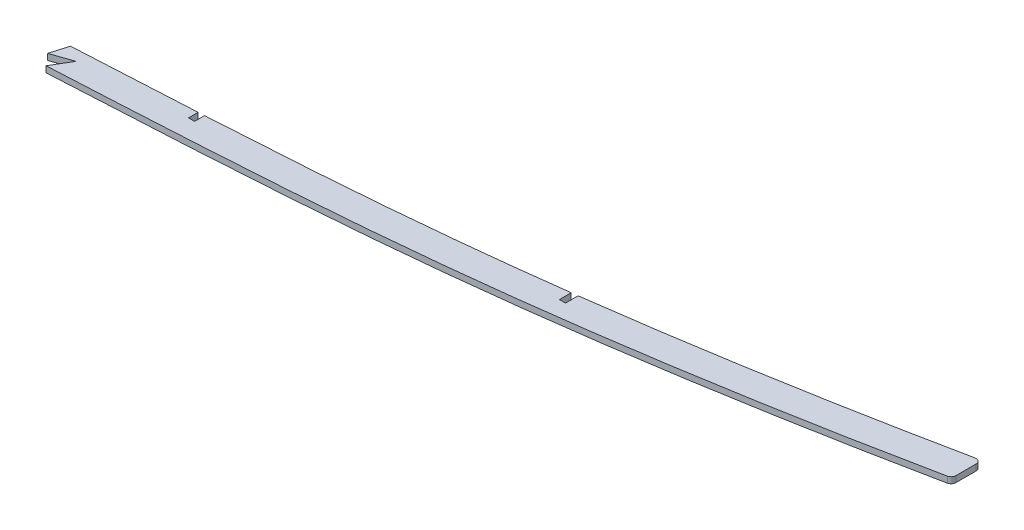
ISO-10303-21;
HEADER;
FILE_DESCRIPTION(('STEP AP214'),'2;1');
FILE_NAME('part.step','',(''),(''),'','','');
FILE_SCHEMA(('AUTOMOTIVE_DESIGN { 1 0 10303 214 1 1 1 1 }'));
ENDSEC;
DATA;
#1=APPLICATION_CONTEXT('core data for automotive mechanical design processes');
#2=APPLICATION_PROTOCOL_DEFINITION('international standard','automotive_design',2000,#1);
#3=PRODUCT_CONTEXT('',#1,'mechanical');
#4=PRODUCT('Part','Part','',(#3));
#5=PRODUCT_RELATED_PRODUCT_CATEGORY('part','',(#4));
#6=PRODUCT_DEFINITION_FORMATION('','',#4);
#7=PRODUCT_DEFINITION_CONTEXT('part definition',#1,'design');
#8=PRODUCT_DEFINITION('design','',#6,#7);
#9=PRODUCT_DEFINITION_SHAPE('','',#8);
#10=(LENGTH_UNIT() NAMED_UNIT(*) SI_UNIT(.MILLI.,.METRE.));
#11=(NAMED_UNIT(*) PLANE_ANGLE_UNIT() SI_UNIT($,.RADIAN.));
#12=(NAMED_UNIT(*) SI_UNIT($,.STERADIAN.) SOLID_ANGLE_UNIT());
#13=UNCERTAINTY_MEASURE_WITH_UNIT(LENGTH_MEASURE(1.E-05),#10,'distance_accuracy_value','');
#14=(GEOMETRIC_REPRESENTATION_CONTEXT(3) GLOBAL_UNCERTAINTY_ASSIGNED_CONTEXT((#13)) GLOBAL_UNIT_ASSIGNED_CONTEXT((#10,
#11,#12)) REPRESENTATION_CONTEXT('',''));
#15=CARTESIAN_POINT('',(0.,0.,0.));
#16=DIRECTION('',(0.,0.,1.));
#17=DIRECTION('',(1.,0.,0.));
#18=AXIS2_PLACEMENT_3D('',#15,#16,#17);
#19=CARTESIAN_POINT('',(2124.37830308858,1.5875,79.252749052653));
#20=CARTESIAN_POINT('',(2148.39751193199,1.5875,78.2710874108631));
#21=CARTESIAN_POINT('',(2196.44142591429,1.5875,76.2202304627624));
#22=CARTESIAN_POINT('',(2256.43632671494,1.5875,73.3193029777612));
#23=CARTESIAN_POINT('',(2304.39682766951,1.5875,70.6868537158113));
#24=CARTESIAN_POINT('',(2340.34200336636,1.5875,68.5440440460852));
#25=CARTESIAN_POINT('',(2376.16909953384,1.5875,66.0999017724206));
#26=CARTESIAN_POINT('',(2423.79225447921,1.5875,62.148433446528));
#27=CARTESIAN_POINT('',(2483.11730251875,1.5875,55.6326510171635));
#28=CARTESIAN_POINT('',(2554.04445691108,1.5875,45.2265308139822));
#29=CARTESIAN_POINT('',(2611.9061277636,1.5875,34.9727556057638));
#30=CARTESIAN_POINT('',(2648.22954061154,1.5875,27.8453657370829));
#31=CARTESIAN_POINT('',(2665.29052708524,1.5875,24.3690973591681));
#32=CARTESIAN_POINT('',(2678.0413738897,1.5875,21.7219433950603));
#33=CARTESIAN_POINT('',(2688.64049273064,1.5875,19.4481755033962));
#34=CARTESIAN_POINT('',(2694.99840626553,1.5875,18.0547973486536));
#35=B_SPLINE_CURVE_WITH_KNOTS('',3,(#19,#20,#21,#22,#23,#24,#25,#26,#27,#28,#29,#30,#31,#32,#33,
#34),.UNSPECIFIED.,.F.,.F.,(4,1,1,1,1,1,1,1,1,1,1,1,1,4),(0.,0.125,0.25,0.3125,0.375,0.4375,0.5,
0.625,0.75,0.875,0.931953524477232,0.943294603731027,0.965976762238616,1.),.UNSPECIFIED.);
#36=DIRECTION('',(0.,-1.,0.));
#37=VECTOR('',#36,1.);
#38=SURFACE_OF_LINEAR_EXTRUSION('',#35,#37);
#39=DIRECTION('',(0.,1.,0.));
#40=VECTOR('',#39,1.);
#41=CARTESIAN_POINT('',(2247.00294082068,-6.0325,73.7374416090095));
#42=LINE('',#41,#40);
#43=CARTESIAN_POINT('',(2247.00297100051,-1.5875,73.7373388385588));
#44=VERTEX_POINT('',#43);
#45=CARTESIAN_POINT('',(2247.00294082068,1.5875,73.7374416090095));
#46=VERTEX_POINT('',#45);
#47=EDGE_CURVE('E396',#44,#46,#42,.T.);
#48=ORIENTED_EDGE('',*,*,#47,.T.);
#49=CARTESIAN_POINT('',(2309.81249999099,1.5875,70.3464793591989));
#50=VERTEX_POINT('',#49);
#51=EDGE_CURVE('E257',#46,#50,#35,.T.);
#52=ORIENTED_EDGE('',*,*,#51,.T.);
#53=DIRECTION('',(0.,1.,0.));
#54=VECTOR('',#53,1.);
#55=CARTESIAN_POINT('',(2309.81249999099,-1.59253086897977,70.3464793591989));
#56=LINE('',#55,#54);
#57=CARTESIAN_POINT('',(2309.81250016668,-1.58943768509903,70.3471683845739));
#58=VERTEX_POINT('',#57);
#59=EDGE_CURVE('E216',#58,#50,#56,.T.);
#60=ORIENTED_EDGE('',*,*,#59,.F.);
#61=CARTESIAN_POINT('',(2309.81243548921,-1.5875,70.3464831006762));
#62=CARTESIAN_POINT('',(2308.00596365719,-1.5875,70.4512689279914));
#63=CARTESIAN_POINT('',(2294.21405123496,-1.5875,71.2457645231676));
#64=CARTESIAN_POINT('',(2273.27921880782,-1.5875,72.3948326745631));
#65=CARTESIAN_POINT('',(2254.14422359782,-1.5875,73.3785943756369));
#66=CARTESIAN_POINT('',(2247.00301133067,-1.5875,73.7374380659046));
#67=B_SPLINE_CURVE_WITH_KNOTS('',3,(#61,#62,#63,#64,#65,#66),.UNSPECIFIED.,.F.,.F.,(4,1,1,4),
(0.212795643069043,0.222216670623599,0.284716670623599,0.321921027554555),.UNSPECIFIED.);
#68=EDGE_CURVE('E182',#44,#58,#67,.F.);
#69=ORIENTED_EDGE('',*,*,#68,.F.);
#70=EDGE_LOOP('',(#48,#52,#60,#69));
#71=FACE_BOUND('',#70,.T.);
#72=ADVANCED_FACE('F40',(#71),#38,.T.);
#73=DIRECTION('',(0.,1.,0.));
#74=VECTOR('',#73,1.);
#75=CARTESIAN_POINT('',(2312.98750000968,-1.59253086897977,70.1615511064757));
#76=LINE('',#75,#74);
#77=CARTESIAN_POINT('',(2312.98750015011,-1.58955240218659,70.1620779425969));
#78=VERTEX_POINT('',#77);
#79=CARTESIAN_POINT('',(2312.98750000968,1.5875,70.1615511064757));
#80=VERTEX_POINT('',#79);
#81=EDGE_CURVE('E384',#78,#80,#76,.T.);
#82=ORIENTED_EDGE('',*,*,#81,.T.);
#83=CARTESIAN_POINT('',(2487.61249999198,1.5875,54.6140447092351));
#84=VERTEX_POINT('',#83);
#85=EDGE_CURVE('E265',#80,#84,#35,.T.);
#86=ORIENTED_EDGE('',*,*,#85,.T.);
#87=DIRECTION('',(0.,1.,0.));
#88=VECTOR('',#87,1.);
#89=CARTESIAN_POINT('',(2487.61249999198,-1.59253086897977,54.6140447092351));
#90=LINE('',#89,#88);
#91=CARTESIAN_POINT('',(2487.61249996659,-1.58960448931468,54.6136136740467));
#92=VERTEX_POINT('',#91);
#93=EDGE_CURVE('E383',#92,#84,#90,.T.);
#94=ORIENTED_EDGE('',*,*,#93,.F.);
#95=CARTESIAN_POINT('',(2487.61259509028,-1.5875,54.6140322910127));
#96=CARTESIAN_POINT('',(2486.09973662627,-1.5875,54.8115859514455));
#97=CARTESIAN_POINT('',(2460.90329768256,-1.5875,58.0724572572028));
#98=CARTESIAN_POINT('',(2423.79225447921,-1.5875,62.148433446528));
#99=CARTESIAN_POINT('',(2376.16909953384,-1.5875,66.0999017724206));
#100=CARTESIAN_POINT('',(2343.19684106611,-1.5875,68.3492856019795));
#101=CARTESIAN_POINT('',(2322.10592172362,-1.5875,69.628219599211));
#102=CARTESIAN_POINT('',(2312.98744837561,-1.5875,70.1615541265246));
#103=B_SPLINE_CURVE_WITH_KNOTS('',3,(#95,#96,#97,#98,#99,#100,#101,#102),.UNSPECIFIED.,.F.,.F.,
(4,1,1,1,1,4),(0.327440704828558,0.335426446252917,0.460426446252917,0.522926446252917,
0.585426446252917,0.632985741424359),.UNSPECIFIED.);
#104=EDGE_CURVE('E188',#78,#92,#103,.F.);
#105=ORIENTED_EDGE('',*,*,#104,.F.);
#106=EDGE_LOOP('',(#82,#86,#94,#105));
#107=FACE_BOUND('',#106,.T.);
#108=ADVANCED_FACE('F246',(#107),#38,.T.);
#109=CARTESIAN_POINT('',(2125.00064017427,1.5875,94.4800369448474));
#110=CARTESIAN_POINT('',(2149.04351205278,1.5875,93.497408198186));
#111=CARTESIAN_POINT('',(2173.08465693507,1.5875,92.4714303186568));
#112=CARTESIAN_POINT('',(2221.16051111618,1.5875,90.2825451342161));
#113=CARTESIAN_POINT('',(2245.19553408109,1.5875,89.1196551679897));
#114=CARTESIAN_POINT('',(2281.23975724731,1.5875,87.2213575710183));
#115=CARTESIAN_POINT('',(2293.25302693238,1.5875,86.5622387735997));
#116=CARTESIAN_POINT('',(2317.27629287288,1.5875,85.1853725215189));
#117=CARTESIAN_POINT('',(2329.28667496271,1.5875,84.4695877060572));
#118=CARTESIAN_POINT('',(2353.30043194924,1.5875,82.9360976908141));
#119=CARTESIAN_POINT('',(2365.30329886088,1.5875,82.1167454790412));
#120=CARTESIAN_POINT('',(2389.29570022096,1.5875,80.3032013832875));
#121=CARTESIAN_POINT('',(2401.28513168761,1.5875,79.3076590137664));
#122=CARTESIAN_POINT('',(2425.248015539,1.5875,77.1070272915958));
#123=CARTESIAN_POINT('',(2437.21939504412,1.5875,75.9021262287262));
#124=CARTESIAN_POINT('',(2461.1350429249,1.5875,73.2728607205226));
#125=CARTESIAN_POINT('',(2473.08021873022,1.5875,71.848649743833));
#126=CARTESIAN_POINT('',(2496.94588972892,1.5875,68.7864051538839));
#127=CARTESIAN_POINT('',(2508.86721006671,1.5875,67.1484398221377));
#128=CARTESIAN_POINT('',(2532.67675150176,1.5875,63.6755945009625));
#129=CARTESIAN_POINT('',(2544.56619473404,1.5875,61.8407677680709));
#130=CARTESIAN_POINT('',(2568.31735906903,1.5875,57.9931353056948));
#131=CARTESIAN_POINT('',(2580.17961126629,1.5875,55.980432346589));
#132=CARTESIAN_POINT('',(2603.8765766664,1.5875,51.794563265322));
#133=CARTESIAN_POINT('',(2615.71090980775,1.5875,49.6216949956207));
#134=CARTESIAN_POINT('',(2639.35036015543,1.5875,45.1250865007013));
#135=CARTESIAN_POINT('',(2651.15621950326,1.5875,42.8015133301686));
#136=CARTESIAN_POINT('',(2674.73471693345,1.5875,37.9973454558139));
#137=CARTESIAN_POINT('',(2686.50776170266,1.5875,35.5172707099935));
#138=CARTESIAN_POINT('',(2698.26092171884,1.5875,32.9414891543206));
#139=B_SPLINE_CURVE_WITH_KNOTS('',3,(#109,#110,#111,#112,#113,#114,#115,#116,#117,#118,#119,
#120,#121,#122,#123,#124,#125,#126,#127,#128,#129,#130,#131,#132,#133,#134,#135,#136,#137,#138),
.UNSPECIFIED.,.F.,.F.,(4,2,2,2,2,2,2,2,2,2,2,2,2,2,4),(0.,0.125,0.25,0.3125,0.375,0.4375,0.5,
0.5625,0.625,0.6875,0.75,0.8125,0.875,0.9375,1.),.UNSPECIFIED.);
#140=DIRECTION('',(0.,-1.,0.));
#141=VECTOR('',#140,1.);
#142=SURFACE_OF_LINEAR_EXTRUSION('',#139,#141);
#143=CARTESIAN_POINT('',(2667.5114279683,1.5875,39.4649997637464));
#144=CARTESIAN_POINT('',(2665.98971683071,1.5875,39.7778020478009));
#145=CARTESIAN_POINT('',(2664.46772760603,1.5875,40.0892658777656));
#146=CARTESIAN_POINT('',(2651.15621950326,1.5875,42.8015133301686));
#147=CARTESIAN_POINT('',(2639.35036015543,1.5875,45.1250865007013));
#148=CARTESIAN_POINT('',(2615.71090980775,1.5875,49.6216949956207));
#149=CARTESIAN_POINT('',(2603.8765766664,1.5875,51.794563265322));
#150=CARTESIAN_POINT('',(2580.17961126629,1.5875,55.980432346589));
#151=CARTESIAN_POINT('',(2568.31735906903,1.5875,57.9931353056948));
#152=CARTESIAN_POINT('',(2544.56619473404,1.5875,61.8407677680709));
#153=CARTESIAN_POINT('',(2532.67675150176,1.5875,63.6755945009625));
#154=CARTESIAN_POINT('',(2508.86721006671,1.5875,67.1484398221377));
#155=CARTESIAN_POINT('',(2496.94588972892,1.5875,68.7864051538839));
#156=CARTESIAN_POINT('',(2473.08021873022,1.5875,71.848649743833));
#157=CARTESIAN_POINT('',(2461.1350429249,1.5875,73.2728607205226));
#158=CARTESIAN_POINT('',(2437.21939504412,1.5875,75.9021262287262));
#159=CARTESIAN_POINT('',(2425.248015539,1.5875,77.1070272915958));
#160=CARTESIAN_POINT('',(2401.28513168761,1.5875,79.3076590137664));
#161=CARTESIAN_POINT('',(2389.29570022096,1.5875,80.3032013832875));
#162=CARTESIAN_POINT('',(2365.30329886088,1.5875,82.1167454790412));
#163=CARTESIAN_POINT('',(2353.30043194924,1.5875,82.9360976908141));
#164=CARTESIAN_POINT('',(2329.28667496271,1.5875,84.4695877060572));
#165=CARTESIAN_POINT('',(2317.27629287288,1.5875,85.1853725215189));
#166=CARTESIAN_POINT('',(2293.25302693238,1.5875,86.5622387735997));
#167=CARTESIAN_POINT('',(2281.23975724731,1.5875,87.2213575710183));
#168=CARTESIAN_POINT('',(2262.63124252424,1.5875,88.2013897559017));
#169=CARTESIAN_POINT('',(2256.03705164536,1.5875,88.5409274300851));
#170=CARTESIAN_POINT('',(2249.44249803493,1.5875,88.8734429780689));
#171=B_SPLINE_CURVE_WITH_KNOTS('',3,(#143,#144,#145,#146,#147,#148,#149,#150,#151,#152,#153,
#154,#155,#156,#157,#158,#159,#160,#161,#162,#163,#164,#165,#166,#167,#168,#169,#170),
.UNSPECIFIED.,.F.,.F.,(4,2,2,2,2,2,2,2,2,2,2,2,2,4),(0.215699564199619,0.223769731691094,
0.286269731691094,0.348769731691094,0.411269731691094,0.473769731691094,0.536269731691094,
0.598769731691094,0.661269731691094,0.723769731691094,0.786269731691094,0.848769731691094,
0.911269731691094,0.945570167491476),.UNSPECIFIED.);
#172=CARTESIAN_POINT('',(2249.44249526015,1.5875,88.873387947819));
#173=VERTEX_POINT('',#172);
#174=CARTESIAN_POINT('',(2667.51142921624,1.5875,39.4650058346806));
#175=VERTEX_POINT('',#174);
#176=EDGE_CURVE('E170',#173,#175,#171,.F.);
#177=ORIENTED_EDGE('',*,*,#176,.F.);
#178=DIRECTION('',(0.,1.,0.));
#179=VECTOR('',#178,1.);
#180=CARTESIAN_POINT('',(2249.44246084476,-6.0325,88.8734462643836));
#181=LINE('',#180,#179);
#182=CARTESIAN_POINT('',(2249.44247793253,-1.5875,88.873417306855));
#183=VERTEX_POINT('',#182);
#184=EDGE_CURVE('E155',#183,#173,#181,.T.);
#185=ORIENTED_EDGE('',*,*,#184,.F.);
#186=CARTESIAN_POINT('',(2249.44249777476,-1.5875,88.8734429911872));
#187=CARTESIAN_POINT('',(2256.03705147193,-1.5875,88.5409274390153));
#188=CARTESIAN_POINT('',(2262.63124243752,-1.5875,88.2013897604685));
#189=CARTESIAN_POINT('',(2281.23975724731,-1.5875,87.2213575710183));
#190=CARTESIAN_POINT('',(2293.25302693238,-1.5875,86.5622387735997));
#191=CARTESIAN_POINT('',(2317.27629287288,-1.5875,85.1853725215189));
#192=CARTESIAN_POINT('',(2329.28667496271,-1.5875,84.4695877060572));
#193=CARTESIAN_POINT('',(2353.30043194924,-1.5875,82.9360976908141));
#194=CARTESIAN_POINT('',(2365.30329886088,-1.5875,82.1167454790412));
#195=CARTESIAN_POINT('',(2389.29570022096,-1.5875,80.3032013832875));
#196=CARTESIAN_POINT('',(2401.28513168761,-1.5875,79.3076590137664));
#197=CARTESIAN_POINT('',(2425.248015539,-1.5875,77.1070272915958));
#198=CARTESIAN_POINT('',(2437.21939504412,-1.5875,75.9021262287262));
#199=CARTESIAN_POINT('',(2461.1350429249,-1.5875,73.2728607205226));
#200=CARTESIAN_POINT('',(2473.08021873022,-1.5875,71.848649743833));
#201=CARTESIAN_POINT('',(2496.94588972892,-1.5875,68.7864051538839));
#202=CARTESIAN_POINT('',(2508.86721006671,-1.5875,67.1484398221377));
#203=CARTESIAN_POINT('',(2532.67675150176,-1.5875,63.6755945009625));
#204=CARTESIAN_POINT('',(2544.56619473404,-1.5875,61.8407677680709));
#205=CARTESIAN_POINT('',(2568.31735906903,-1.5875,57.9931353056948));
#206=CARTESIAN_POINT('',(2580.17961126629,-1.5875,55.980432346589));
#207=CARTESIAN_POINT('',(2603.8765766664,-1.5875,51.794563265322));
#208=CARTESIAN_POINT('',(2615.71090980775,-1.5875,49.6216949956207));
#209=CARTESIAN_POINT('',(2639.35036015543,-1.5875,45.1250865007013));
#210=CARTESIAN_POINT('',(2651.15621950326,-1.5875,42.8015133301686));
#211=CARTESIAN_POINT('',(2664.46772760598,-1.5875,40.0892658777745));
#212=CARTESIAN_POINT('',(2665.98971683062,-1.5875,39.7778020478188));
#213=CARTESIAN_POINT('',(2667.51142796817,-1.5875,39.4649997637734));
#214=B_SPLINE_CURVE_WITH_KNOTS('',3,(#186,#187,#188,#189,#190,#191,#192,#193,#194,#195,#196,
#197,#198,#199,#200,#201,#202,#203,#204,#205,#206,#207,#208,#209,#210,#211,#212,#213),
.UNSPECIFIED.,.F.,.F.,(4,2,2,2,2,2,2,2,2,2,2,2,2,4),(0.215699563748549,0.25,0.3125,0.375,0.4375,
0.5,0.5625,0.625,0.6875,0.75,0.8125,0.875,0.9375,0.945570167491243),.UNSPECIFIED.);
#215=CARTESIAN_POINT('',(2667.51142921133,-1.5875,39.4650058111133));
#216=VERTEX_POINT('',#215);
#217=EDGE_CURVE('E209',#183,#216,#214,.T.);
#218=ORIENTED_EDGE('',*,*,#217,.T.);
#219=DIRECTION('',(0.,-1.,0.));
#220=VECTOR('',#219,1.);
#221=CARTESIAN_POINT('',(2667.51142796811,-1.5875,39.4649997637866));
#222=LINE('',#221,#220);
#223=EDGE_CURVE('E178',#216,#175,#222,.F.);
#224=ORIENTED_EDGE('',*,*,#223,.T.);
#225=EDGE_LOOP('',(#177,#185,#218,#224));
#226=FACE_BOUND('',#225,.T.);
#227=ADVANCED_FACE('F176',(#226),#142,.F.);
#228=CARTESIAN_POINT('',(2669.54,1.5875,7.61745278554091E-11));
#229=DIRECTION('',(-1.,0.,0.));
#230=DIRECTION('',(0.,0.,1.));
#231=AXIS2_PLACEMENT_3D('',#228,#229,#230);
#232=PLANE('',#231);
#233=DIRECTION('',(0.,0.,-1.));
#234=VECTOR('',#233,1.);
#235=CARTESIAN_POINT('',(2669.54,1.5875,7.61745278554091E-11));
#236=LINE('',#235,#234);
#237=CARTESIAN_POINT('',(2669.54,1.5875,36.9770203761231));
#238=VERTEX_POINT('',#237);
#239=CARTESIAN_POINT('',(2669.54,1.5875,26.6037358813341));
#240=VERTEX_POINT('',#239);
#241=EDGE_CURVE('E181',#238,#240,#236,.T.);
#242=ORIENTED_EDGE('',*,*,#241,.F.);
#243=DIRECTION('',(0.,-1.,0.));
#244=VECTOR('',#243,1.);
#245=CARTESIAN_POINT('',(2669.54,1.5875,36.9770203761231));
#246=LINE('',#245,#244);
#247=CARTESIAN_POINT('',(2669.54,-1.5875,36.9770203761231));
#248=VERTEX_POINT('',#247);
#249=EDGE_CURVE('E373',#238,#248,#246,.T.);
#250=ORIENTED_EDGE('',*,*,#249,.T.);
#251=DIRECTION('',(0.,0.,-1.));
#252=VECTOR('',#251,1.);
#253=CARTESIAN_POINT('',(2669.54,-1.5875,7.61745278554091E-11));
#254=LINE('',#253,#252);
#255=CARTESIAN_POINT('',(2669.54,-1.5875,26.6037358813341));
#256=VERTEX_POINT('',#255);
#257=EDGE_CURVE('E202',#248,#256,#254,.T.);
#258=ORIENTED_EDGE('',*,*,#257,.T.);
#259=DIRECTION('',(0.,1.,0.));
#260=VECTOR('',#259,1.);
#261=CARTESIAN_POINT('',(2669.54,1.5875,26.6037358813341));
#262=LINE('',#261,#260);
#263=EDGE_CURVE('E222',#256,#240,#262,.T.);
#264=ORIENTED_EDGE('',*,*,#263,.T.);
#265=EDGE_LOOP('',(#242,#250,#258,#264));
#266=FACE_BOUND('',#265,.T.);
#267=ADVANCED_FACE('F245',(#266),#232,.F.);
#268=DIRECTION('',(0.,1.,0.));
#269=VECTOR('',#268,1.);
#270=CARTESIAN_POINT('',(2490.78750000951,-1.59253086897977,54.1968621626459));
#271=LINE('',#270,#269);
#272=CARTESIAN_POINT('',(2490.78749999507,-1.58958327753817,54.1964056260482));
#273=VERTEX_POINT('',#272);
#274=CARTESIAN_POINT('',(2490.78750000951,1.5875,54.1968621626459));
#275=VERTEX_POINT('',#274);
#276=EDGE_CURVE('E414',#273,#275,#271,.T.);
#277=ORIENTED_EDGE('',*,*,#276,.T.);
#278=CARTESIAN_POINT('',(2666.48659261307,1.5875,24.1161642029609));
#279=VERTEX_POINT('',#278);
#280=EDGE_CURVE('E186',#275,#279,#35,.T.);
#281=ORIENTED_EDGE('',*,*,#280,.T.);
#282=DIRECTION('',(0.,-1.,0.));
#283=VECTOR('',#282,1.);
#284=CARTESIAN_POINT('',(2666.48659261307,1.5875,24.1161642029604));
#285=LINE('',#284,#283);
#286=CARTESIAN_POINT('',(2666.48659261307,-1.5875,24.1161642029605));
#287=VERTEX_POINT('',#286);
#288=EDGE_CURVE('E310',#279,#287,#285,.T.);
#289=ORIENTED_EDGE('',*,*,#288,.T.);
#290=CARTESIAN_POINT('',(2666.48659261307,-1.5875,24.1161642029605));
#291=CARTESIAN_POINT('',(2665.37895815167,-1.5875,24.344767752134));
#292=CARTESIAN_POINT('',(2662.1451746936,-1.5875,25.0099799407997));
#293=CARTESIAN_POINT('',(2648.22954061154,-1.5875,27.8453657370829));
#294=CARTESIAN_POINT('',(2611.9061277636,-1.5875,34.9727556057638));
#295=CARTESIAN_POINT('',(2556.60295317492,-1.5875,44.7731348927441));
#296=CARTESIAN_POINT('',(2511.89347682993,-1.5875,51.4065012404069));
#297=CARTESIAN_POINT('',(2490.787601232,-1.5875,54.1968487803118));
#298=B_SPLINE_CURVE_WITH_KNOTS('',3,(#290,#291,#292,#293,#294,#295,#296,#297),.UNSPECIFIED.,.F.,
.F.,(4,1,1,1,1,4),(0.638572705972341,0.644482447648598,0.655823526902393,0.712777051379625,
0.837777051379625,0.949204345407284),.UNSPECIFIED.);
#299=EDGE_CURVE('E196',#273,#287,#298,.F.);
#300=ORIENTED_EDGE('',*,*,#299,.F.);
#301=EDGE_LOOP('',(#277,#281,#289,#300));
#302=FACE_BOUND('',#301,.T.);
#303=ADVANCED_FACE('F272',(#302),#38,.T.);
#304=CARTESIAN_POINT('',(0.,1.5875,0.));
#305=DIRECTION('',(0.,1.,0.));
#306=DIRECTION('',(0.,0.,1.));
#307=AXIS2_PLACEMENT_3D('',#304,#305,#306);
#308=PLANE('',#307);
#309=DIRECTION('',(0.281709891618831,0.,-0.959499628433543));
#310=VECTOR('',#309,1.);
#311=CARTESIAN_POINT('',(2247.00294082068,1.5875,73.7374416090095));
#312=LINE('',#311,#310);
#313=CARTESIAN_POINT('',(2244.31061590084,1.5875,82.9074595496765));
#314=VERTEX_POINT('',#313);
#315=EDGE_CURVE('E165',#314,#46,#312,.T.);
#316=ORIENTED_EDGE('',*,*,#315,.F.);
#317=DIRECTION('',(-0.944756611917633,0.,0.327772702093868));
#318=VECTOR('',#317,1.);
#319=CARTESIAN_POINT('',(2244.31061590084,1.5875,82.9074595496765));
#320=LINE('',#319,#318);
#321=CARTESIAN_POINT('',(2255.27963870823,1.5875,79.1018802083375));
#322=VERTEX_POINT('',#321);
#323=EDGE_CURVE('E173',#322,#314,#320,.T.);
#324=ORIENTED_EDGE('',*,*,#323,.F.);
#325=DIRECTION('',(0.512830577802956,0.,-0.858489835973779));
#326=VECTOR('',#325,1.);
#327=CARTESIAN_POINT('',(2255.27963870823,1.5875,79.1018802083375));
#328=LINE('',#327,#326);
#329=EDGE_CURVE('E158',#173,#322,#328,.T.);
#330=ORIENTED_EDGE('',*,*,#329,.F.);
#331=ORIENTED_EDGE('',*,*,#176,.T.);
#332=CARTESIAN_POINT('',(2667.,1.5875,36.977020376123));
#333=DIRECTION('',(0.,1.,0.));
#334=DIRECTION('',(0.,0.,1.));
#335=AXIS2_PLACEMENT_3D('',#332,#333,#334);
#336=CIRCLE('',#335,2.54);
#337=EDGE_CURVE('E349',#175,#238,#336,.T.);
#338=ORIENTED_EDGE('',*,*,#337,.T.);
#339=ORIENTED_EDGE('',*,*,#241,.T.);
#340=CARTESIAN_POINT('',(2667.,1.5875,26.603735881334));
#341=DIRECTION('',(0.,1.,0.));
#342=DIRECTION('',(0.,0.,1.));
#343=AXIS2_PLACEMENT_3D('',#340,#341,#342);
#344=CIRCLE('',#343,2.54);
#345=EDGE_CURVE('E351',#240,#279,#344,.T.);
#346=ORIENTED_EDGE('',*,*,#345,.T.);
#347=ORIENTED_EDGE('',*,*,#280,.F.);
#348=DIRECTION('',(0.,0.,-1.));
#349=VECTOR('',#348,1.);
#350=CARTESIAN_POINT('',(2490.7875,1.5875,0.));
#351=LINE('',#350,#349);
#352=CARTESIAN_POINT('',(2490.7875,1.5875,60.7560979745416));
#353=VERTEX_POINT('',#352);
#354=EDGE_CURVE('E378',#353,#275,#351,.T.);
#355=ORIENTED_EDGE('',*,*,#354,.F.);
#356=DIRECTION('',(1.,0.,0.));
#357=VECTOR('',#356,1.);
#358=CARTESIAN_POINT('',(0.,1.5875,60.7560979745416));
#359=LINE('',#358,#357);
#360=CARTESIAN_POINT('',(2487.6125,1.5875,60.7560979745416));
#361=VERTEX_POINT('',#360);
#362=EDGE_CURVE('E392',#361,#353,#359,.T.);
#363=ORIENTED_EDGE('',*,*,#362,.F.);
#364=DIRECTION('',(0.,0.,1.));
#365=VECTOR('',#364,1.);
#366=CARTESIAN_POINT('',(2487.6125,1.5875,-1.79861980512432E-10));
#367=LINE('',#366,#365);
#368=EDGE_CURVE('E390',#84,#361,#367,.T.);
#369=ORIENTED_EDGE('',*,*,#368,.F.);
#370=ORIENTED_EDGE('',*,*,#85,.F.);
#371=DIRECTION('',(0.,0.,-1.));
#372=VECTOR('',#371,1.);
#373=CARTESIAN_POINT('',(2312.98749999999,1.5875,-1.98577437911382E-10));
#374=LINE('',#373,#372);
#375=CARTESIAN_POINT('',(2312.9875,1.5875,75.3342072103694));
#376=VERTEX_POINT('',#375);
#377=EDGE_CURVE('E388',#376,#80,#374,.T.);
#378=ORIENTED_EDGE('',*,*,#377,.F.);
#379=DIRECTION('',(1.,0.,0.));
#380=VECTOR('',#379,1.);
#381=CARTESIAN_POINT('',(0.,1.5875,75.3342072103694));
#382=LINE('',#381,#380);
#383=CARTESIAN_POINT('',(2309.8125,1.5875,75.3342072103694));
#384=VERTEX_POINT('',#383);
#385=EDGE_CURVE('E433',#384,#376,#382,.T.);
#386=ORIENTED_EDGE('',*,*,#385,.F.);
#387=DIRECTION('',(0.,0.,1.));
#388=VECTOR('',#387,1.);
#389=CARTESIAN_POINT('',(2309.8125,1.5875,0.));
#390=LINE('',#389,#388);
#391=EDGE_CURVE('E430',#50,#384,#390,.T.);
#392=ORIENTED_EDGE('',*,*,#391,.F.);
#393=ORIENTED_EDGE('',*,*,#51,.F.);
#394=EDGE_LOOP('',(#316,#324,#330,#331,#338,#339,#346,#347,#355,#363,#369,#370,#378,#386,#392,#393));
#395=FACE_BOUND('',#394,.T.);
#396=ADVANCED_FACE('F169',(#395),#308,.T.);
#397=CARTESIAN_POINT('',(0.,-1.5875,0.));
#398=DIRECTION('',(0.,1.,0.));
#399=DIRECTION('',(0.,0.,1.));
#400=AXIS2_PLACEMENT_3D('',#397,#398,#399);
#401=PLANE('',#400);
#402=DIRECTION('',(-0.944756611917633,0.,0.327772702093868));
#403=VECTOR('',#402,1.);
#404=CARTESIAN_POINT('',(266.790959777028,-1.5875,768.985707592622));
#405=LINE('',#404,#403);
#406=CARTESIAN_POINT('',(2255.27963870823,-1.5875,79.1018802083375));
#407=VERTEX_POINT('',#406);
#408=CARTESIAN_POINT('',(2244.31061590084,-1.5875,82.9074595496765));
#409=VERTEX_POINT('',#408);
#410=EDGE_CURVE('E51',#407,#409,#405,.T.);
#411=ORIENTED_EDGE('',*,*,#410,.T.);
#412=DIRECTION('',(0.281709891618831,0.,-0.959499628433543));
#413=VECTOR('',#412,1.);
#414=CARTESIAN_POINT('',(2088.61101700897,-1.5875,613.217937557803));
#415=LINE('',#414,#413);
#416=EDGE_CURVE('E11',#409,#44,#415,.T.);
#417=ORIENTED_EDGE('',*,*,#416,.T.);
#418=ORIENTED_EDGE('',*,*,#68,.T.);
#419=DIRECTION('',(0.,0.,1.));
#420=VECTOR('',#419,1.);
#421=CARTESIAN_POINT('',(2309.8125,-1.5875,0.));
#422=LINE('',#421,#420);
#423=CARTESIAN_POINT('',(2309.8125,-1.5875,75.3342072103694));
#424=VERTEX_POINT('',#423);
#425=EDGE_CURVE('E327',#58,#424,#422,.T.);
#426=ORIENTED_EDGE('',*,*,#425,.T.);
#427=DIRECTION('',(1.,0.,0.));
#428=VECTOR('',#427,1.);
#429=CARTESIAN_POINT('',(0.,-1.5875,75.3342072103694));
#430=LINE('',#429,#428);
#431=CARTESIAN_POINT('',(2312.9875,-1.5875,75.3342072103694));
#432=VERTEX_POINT('',#431);
#433=EDGE_CURVE('E318',#424,#432,#430,.T.);
#434=ORIENTED_EDGE('',*,*,#433,.T.);
#435=DIRECTION('',(0.,0.,-1.));
#436=VECTOR('',#435,1.);
#437=CARTESIAN_POINT('',(2312.98749999999,-1.5875,-1.98577437911382E-10));
#438=LINE('',#437,#436);
#439=EDGE_CURVE('E324',#432,#78,#438,.T.);
#440=ORIENTED_EDGE('',*,*,#439,.T.);
#441=ORIENTED_EDGE('',*,*,#104,.T.);
#442=DIRECTION('',(0.,0.,1.));
#443=VECTOR('',#442,1.);
#444=CARTESIAN_POINT('',(2487.6125,-1.5875,-1.79861980512432E-10));
#445=LINE('',#444,#443);
#446=CARTESIAN_POINT('',(2487.6125,-1.5875,60.7560979745416));
#447=VERTEX_POINT('',#446);
#448=EDGE_CURVE('E313',#92,#447,#445,.T.);
#449=ORIENTED_EDGE('',*,*,#448,.T.);
#450=DIRECTION('',(1.,0.,0.));
#451=VECTOR('',#450,1.);
#452=CARTESIAN_POINT('',(0.,-1.5875,60.7560979745416));
#453=LINE('',#452,#451);
#454=CARTESIAN_POINT('',(2490.7875,-1.5875,60.7560979745416));
#455=VERTEX_POINT('',#454);
#456=EDGE_CURVE('E305',#447,#455,#453,.T.);
#457=ORIENTED_EDGE('',*,*,#456,.T.);
#458=DIRECTION('',(0.,0.,-1.));
#459=VECTOR('',#458,1.);
#460=CARTESIAN_POINT('',(2490.7875,-1.5875,0.));
#461=LINE('',#460,#459);
#462=EDGE_CURVE('E309',#455,#273,#461,.T.);
#463=ORIENTED_EDGE('',*,*,#462,.T.);
#464=ORIENTED_EDGE('',*,*,#299,.T.);
#465=CARTESIAN_POINT('',(2667.,-1.5875,26.603735881334));
#466=DIRECTION('',(0.,1.,0.));
#467=DIRECTION('',(0.,0.,1.));
#468=AXIS2_PLACEMENT_3D('',#465,#466,#467);
#469=CIRCLE('',#468,2.54);
#470=EDGE_CURVE('E286',#287,#256,#469,.F.);
#471=ORIENTED_EDGE('',*,*,#470,.T.);
#472=ORIENTED_EDGE('',*,*,#257,.F.);
#473=CARTESIAN_POINT('',(2667.,-1.5875,36.977020376123));
#474=DIRECTION('',(0.,1.,0.));
#475=DIRECTION('',(0.,0.,1.));
#476=AXIS2_PLACEMENT_3D('',#473,#474,#475);
#477=CIRCLE('',#476,2.54);
#478=EDGE_CURVE('E344',#248,#216,#477,.F.);
#479=ORIENTED_EDGE('',*,*,#478,.T.);
#480=ORIENTED_EDGE('',*,*,#217,.F.);
#481=DIRECTION('',(0.512830577802956,0.,-0.858489835973779));
#482=VECTOR('',#481,1.);
#483=CARTESIAN_POINT('',(1696.97729663539,-1.5875,1013.71246470833));
#484=LINE('',#483,#482);
#485=EDGE_CURVE('E161',#183,#407,#484,.T.);
#486=ORIENTED_EDGE('',*,*,#485,.T.);
#487=EDGE_LOOP('',(#411,#417,#418,#426,#434,#440,#441,#449,#457,#463,#464,#471,#472,#479,#480,#486));
#488=FACE_BOUND('',#487,.T.);
#489=ADVANCED_FACE('F276',(#488),#401,.F.);
#490=CARTESIAN_POINT('',(2667.,0.,36.977020376123));
#491=DIRECTION('',(0.,-1.,0.));
#492=DIRECTION('',(0.,0.,-1.));
#493=AXIS2_PLACEMENT_3D('',#490,#491,#492);
#494=CYLINDRICAL_SURFACE('',#493,2.54);
#495=ORIENTED_EDGE('',*,*,#337,.F.);
#496=ORIENTED_EDGE('',*,*,#223,.F.);
#497=ORIENTED_EDGE('',*,*,#478,.F.);
#498=ORIENTED_EDGE('',*,*,#249,.F.);
#499=EDGE_LOOP('',(#495,#496,#497,#498));
#500=FACE_BOUND('',#499,.T.);
#501=ADVANCED_FACE('F248',(#500),#494,.T.);
#502=CARTESIAN_POINT('',(2667.,0.,26.603735881334));
#503=DIRECTION('',(0.,-1.,0.));
#504=DIRECTION('',(0.,0.,-1.));
#505=AXIS2_PLACEMENT_3D('',#502,#503,#504);
#506=CYLINDRICAL_SURFACE('',#505,2.54);
#507=ORIENTED_EDGE('',*,*,#345,.F.);
#508=ORIENTED_EDGE('',*,*,#263,.F.);
#509=ORIENTED_EDGE('',*,*,#470,.F.);
#510=ORIENTED_EDGE('',*,*,#288,.F.);
#511=EDGE_LOOP('',(#507,#508,#509,#510));
#512=FACE_BOUND('',#511,.T.);
#513=ADVANCED_FACE('F42',(#512),#506,.T.);
#514=CARTESIAN_POINT('',(2487.6125,-1.59253086897977,-1.79861980512432E-10));
#515=DIRECTION('',(-1.,0.,0.));
#516=DIRECTION('',(0.,0.,1.));
#517=AXIS2_PLACEMENT_3D('',#514,#515,#516);
#518=PLANE('',#517);
#519=ORIENTED_EDGE('',*,*,#93,.T.);
#520=ORIENTED_EDGE('',*,*,#368,.T.);
#521=DIRECTION('',(0.,1.,0.));
#522=VECTOR('',#521,1.);
#523=CARTESIAN_POINT('',(2487.6125,-1.59253086897977,60.7560979745416));
#524=LINE('',#523,#522);
#525=EDGE_CURVE('E410',#447,#361,#524,.T.);
#526=ORIENTED_EDGE('',*,*,#525,.F.);
#527=ORIENTED_EDGE('',*,*,#448,.F.);
#528=EDGE_LOOP('',(#519,#520,#526,#527));
#529=FACE_BOUND('',#528,.T.);
#530=ADVANCED_FACE('F530',(#529),#518,.F.);
#531=CARTESIAN_POINT('',(2490.7875,-1.59253086897977,0.));
#532=DIRECTION('',(1.,0.,0.));
#533=DIRECTION('',(0.,0.,-1.));
#534=AXIS2_PLACEMENT_3D('',#531,#532,#533);
#535=PLANE('',#534);
#536=DIRECTION('',(0.,1.,0.));
#537=VECTOR('',#536,1.);
#538=CARTESIAN_POINT('',(2490.7875,-1.59253086897977,60.7560979745416));
#539=LINE('',#538,#537);
#540=EDGE_CURVE('E411',#455,#353,#539,.T.);
#541=ORIENTED_EDGE('',*,*,#540,.T.);
#542=ORIENTED_EDGE('',*,*,#354,.T.);
#543=ORIENTED_EDGE('',*,*,#276,.F.);
#544=ORIENTED_EDGE('',*,*,#462,.F.);
#545=EDGE_LOOP('',(#541,#542,#543,#544));
#546=FACE_BOUND('',#545,.T.);
#547=ADVANCED_FACE('F536',(#546),#535,.F.);
#548=CARTESIAN_POINT('',(0.,-1.59253086897977,60.7560979745416));
#549=DIRECTION('',(0.,0.,1.));
#550=DIRECTION('',(1.,0.,0.));
#551=AXIS2_PLACEMENT_3D('',#548,#549,#550);
#552=PLANE('',#551);
#553=ORIENTED_EDGE('',*,*,#525,.T.);
#554=ORIENTED_EDGE('',*,*,#362,.T.);
#555=ORIENTED_EDGE('',*,*,#540,.F.);
#556=ORIENTED_EDGE('',*,*,#456,.F.);
#557=EDGE_LOOP('',(#553,#554,#555,#556));
#558=FACE_BOUND('',#557,.T.);
#559=ADVANCED_FACE('F543',(#558),#552,.F.);
#560=CARTESIAN_POINT('',(2309.8125,-1.59253086897977,0.));
#561=DIRECTION('',(-1.,0.,0.));
#562=DIRECTION('',(0.,0.,1.));
#563=AXIS2_PLACEMENT_3D('',#560,#561,#562);
#564=PLANE('',#563);
#565=ORIENTED_EDGE('',*,*,#59,.T.);
#566=ORIENTED_EDGE('',*,*,#391,.T.);
#567=DIRECTION('',(0.,1.,0.));
#568=VECTOR('',#567,1.);
#569=CARTESIAN_POINT('',(2309.8125,-1.59253086897977,75.3342072103694));
#570=LINE('',#569,#568);
#571=EDGE_CURVE('E405',#424,#384,#570,.T.);
#572=ORIENTED_EDGE('',*,*,#571,.F.);
#573=ORIENTED_EDGE('',*,*,#425,.F.);
#574=EDGE_LOOP('',(#565,#566,#572,#573));
#575=FACE_BOUND('',#574,.T.);
#576=ADVANCED_FACE('F447',(#575),#564,.F.);
#577=CARTESIAN_POINT('',(2312.98749999999,-1.59253086897977,-1.98577437911382E-10));
#578=DIRECTION('',(1.,0.,0.));
#579=DIRECTION('',(0.,0.,-1.));
#580=AXIS2_PLACEMENT_3D('',#577,#578,#579);
#581=PLANE('',#580);
#582=DIRECTION('',(0.,1.,0.));
#583=VECTOR('',#582,1.);
#584=CARTESIAN_POINT('',(2312.9875,-1.59253086897977,75.3342072103694));
#585=LINE('',#584,#583);
#586=EDGE_CURVE('E67',#432,#376,#585,.T.);
#587=ORIENTED_EDGE('',*,*,#586,.T.);
#588=ORIENTED_EDGE('',*,*,#377,.T.);
#589=ORIENTED_EDGE('',*,*,#81,.F.);
#590=ORIENTED_EDGE('',*,*,#439,.F.);
#591=EDGE_LOOP('',(#587,#588,#589,#590));
#592=FACE_BOUND('',#591,.T.);
#593=ADVANCED_FACE('F476',(#592),#581,.F.);
#594=CARTESIAN_POINT('',(0.,-1.59253086897977,75.3342072103694));
#595=DIRECTION('',(0.,0.,1.));
#596=DIRECTION('',(1.,0.,0.));
#597=AXIS2_PLACEMENT_3D('',#594,#595,#596);
#598=PLANE('',#597);
#599=ORIENTED_EDGE('',*,*,#571,.T.);
#600=ORIENTED_EDGE('',*,*,#385,.T.);
#601=ORIENTED_EDGE('',*,*,#586,.F.);
#602=ORIENTED_EDGE('',*,*,#433,.F.);
#603=EDGE_LOOP('',(#599,#600,#601,#602));
#604=FACE_BOUND('',#603,.T.);
#605=ADVANCED_FACE('F446',(#604),#598,.F.);
#606=CARTESIAN_POINT('',(2247.00294082068,-6.0325,73.7374416090095));
#607=DIRECTION('',(0.959499628433543,0.,0.281709891618831));
#608=DIRECTION('',(0.281709891618831,0.,-0.959499628433543));
#609=AXIS2_PLACEMENT_3D('',#606,#607,#608);
#610=PLANE('',#609);
#611=DIRECTION('',(0.,1.,0.));
#612=VECTOR('',#611,1.);
#613=CARTESIAN_POINT('',(2244.31061590084,-6.0325,82.9074595496765));
#614=LINE('',#613,#612);
#615=EDGE_CURVE('E402',#409,#314,#614,.T.);
#616=ORIENTED_EDGE('',*,*,#615,.T.);
#617=ORIENTED_EDGE('',*,*,#315,.T.);
#618=ORIENTED_EDGE('',*,*,#47,.F.);
#619=ORIENTED_EDGE('',*,*,#416,.F.);
#620=EDGE_LOOP('',(#616,#617,#618,#619));
#621=FACE_BOUND('',#620,.T.);
#622=ADVANCED_FACE('F468',(#621),#610,.F.);
#623=CARTESIAN_POINT('',(2244.31061590084,-6.0325,82.9074595496765));
#624=DIRECTION('',(-0.327772702093868,0.,-0.944756611917633));
#625=DIRECTION('',(-0.944756611917633,0.,0.327772702093868));
#626=AXIS2_PLACEMENT_3D('',#623,#624,#625);
#627=PLANE('',#626);
#628=DIRECTION('',(0.,1.,0.));
#629=VECTOR('',#628,1.);
#630=CARTESIAN_POINT('',(2255.27963870823,-6.0325,79.1018802083375));
#631=LINE('',#630,#629);
#632=EDGE_CURVE('E59',#407,#322,#631,.T.);
#633=ORIENTED_EDGE('',*,*,#632,.T.);
#634=ORIENTED_EDGE('',*,*,#323,.T.);
#635=ORIENTED_EDGE('',*,*,#615,.F.);
#636=ORIENTED_EDGE('',*,*,#410,.F.);
#637=EDGE_LOOP('',(#633,#634,#635,#636));
#638=FACE_BOUND('',#637,.T.);
#639=ADVANCED_FACE('F466',(#638),#627,.F.);
#640=CARTESIAN_POINT('',(2255.27963870823,-6.0325,79.1018802083375));
#641=DIRECTION('',(0.858489835973779,0.,0.512830577802956));
#642=DIRECTION('',(0.512830577802956,0.,-0.858489835973779));
#643=AXIS2_PLACEMENT_3D('',#640,#641,#642);
#644=PLANE('',#643);
#645=ORIENTED_EDGE('',*,*,#184,.T.);
#646=ORIENTED_EDGE('',*,*,#329,.T.);
#647=ORIENTED_EDGE('',*,*,#632,.F.);
#648=ORIENTED_EDGE('',*,*,#485,.F.);
#649=EDGE_LOOP('',(#645,#646,#647,#648));
#650=FACE_BOUND('',#649,.T.);
#651=ADVANCED_FACE('F157',(#650),#644,.F.);
#652=CLOSED_SHELL('',(#72,#108,#227,#267,#303,#396,#489,#501,#513,#530,#547,#559,#576,#593,#605,
#622,#639,#651));
#653=MANIFOLD_SOLID_BREP('B2',#652);
#654=ADVANCED_BREP_SHAPE_REPRESENTATION('',(#18,#653),#14);
#655=SHAPE_DEFINITION_REPRESENTATION(#9,#654);
ENDSEC;
END-ISO-10303-21;
